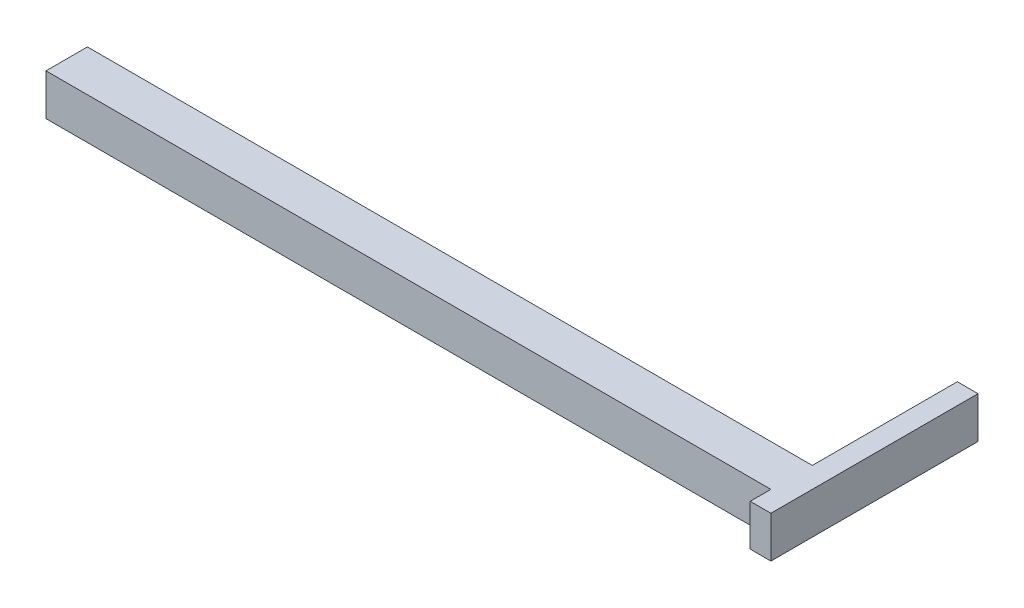
ISO-10303-21;
HEADER;
FILE_DESCRIPTION(('STEP AP214'),'2;1');
FILE_NAME('part.step','',(''),(''),'','','');
FILE_SCHEMA(('AUTOMOTIVE_DESIGN { 1 0 10303 214 1 1 1 1 }'));
ENDSEC;
DATA;
#1=APPLICATION_CONTEXT('core data for automotive mechanical design processes');
#2=APPLICATION_PROTOCOL_DEFINITION('international standard','automotive_design',2000,#1);
#3=PRODUCT_CONTEXT('',#1,'mechanical');
#4=PRODUCT('Part','Part','',(#3));
#5=PRODUCT_RELATED_PRODUCT_CATEGORY('part','',(#4));
#6=PRODUCT_DEFINITION_FORMATION('','',#4);
#7=PRODUCT_DEFINITION_CONTEXT('part definition',#1,'design');
#8=PRODUCT_DEFINITION('design','',#6,#7);
#9=PRODUCT_DEFINITION_SHAPE('','',#8);
#10=(LENGTH_UNIT() NAMED_UNIT(*) SI_UNIT(.MILLI.,.METRE.));
#11=(NAMED_UNIT(*) PLANE_ANGLE_UNIT() SI_UNIT($,.RADIAN.));
#12=(NAMED_UNIT(*) SI_UNIT($,.STERADIAN.) SOLID_ANGLE_UNIT());
#13=UNCERTAINTY_MEASURE_WITH_UNIT(LENGTH_MEASURE(1.E-05),#10,'distance_accuracy_value','');
#14=(GEOMETRIC_REPRESENTATION_CONTEXT(3) GLOBAL_UNCERTAINTY_ASSIGNED_CONTEXT((#13)) GLOBAL_UNIT_ASSIGNED_CONTEXT((#10,
#11,#12)) REPRESENTATION_CONTEXT('',''));
#15=CARTESIAN_POINT('',(0.,0.,0.));
#16=DIRECTION('',(0.,0.,1.));
#17=DIRECTION('',(1.,0.,0.));
#18=AXIS2_PLACEMENT_3D('',#15,#16,#17);
#19=CARTESIAN_POINT('',(-1750.,-100.,200.));
#20=DIRECTION('',(1.,0.,0.));
#21=DIRECTION('',(0.,0.,-1.));
#22=AXIS2_PLACEMENT_3D('',#19,#20,#21);
#23=PLANE('',#22);
#24=DIRECTION('',(0.,-1.,0.));
#25=VECTOR('',#24,1.);
#26=CARTESIAN_POINT('',(-1750.,-100.,0.));
#27=LINE('',#26,#25);
#28=CARTESIAN_POINT('',(-1750.,99.9999999999998,0.));
#29=VERTEX_POINT('',#28);
#30=CARTESIAN_POINT('',(-1750.,-100.,0.));
#31=VERTEX_POINT('',#30);
#32=EDGE_CURVE('E105',#29,#31,#27,.T.);
#33=ORIENTED_EDGE('',*,*,#32,.T.);
#34=DIRECTION('',(0.,0.,-1.));
#35=VECTOR('',#34,1.);
#36=CARTESIAN_POINT('',(-1750.,-100.,200.));
#37=LINE('',#36,#35);
#38=CARTESIAN_POINT('',(-1750.,-100.,200.));
#39=VERTEX_POINT('',#38);
#40=EDGE_CURVE('E11',#39,#31,#37,.T.);
#41=ORIENTED_EDGE('',*,*,#40,.F.);
#42=DIRECTION('',(0.,-1.,0.));
#43=VECTOR('',#42,1.);
#44=CARTESIAN_POINT('',(-1750.,-100.,200.));
#45=LINE('',#44,#43);
#46=CARTESIAN_POINT('',(-1750.,99.9999999999998,200.));
#47=VERTEX_POINT('',#46);
#48=EDGE_CURVE('E96',#47,#39,#45,.T.);
#49=ORIENTED_EDGE('',*,*,#48,.F.);
#50=DIRECTION('',(0.,0.,-1.));
#51=VECTOR('',#50,1.);
#52=CARTESIAN_POINT('',(-1750.,99.9999999999998,200.));
#53=LINE('',#52,#51);
#54=EDGE_CURVE('E48',#47,#29,#53,.T.);
#55=ORIENTED_EDGE('',*,*,#54,.T.);
#56=EDGE_LOOP('',(#33,#41,#49,#55));
#57=FACE_BOUND('',#56,.T.);
#58=ADVANCED_FACE('F39',(#57),#23,.F.);
#59=CARTESIAN_POINT('',(1750.,-99.9999999999998,200.));
#60=DIRECTION('',(0.,1.,0.));
#61=DIRECTION('',(-1.,0.,0.));
#62=AXIS2_PLACEMENT_3D('',#59,#60,#61);
#63=PLANE('',#62);
#64=DIRECTION('',(1.,0.,0.));
#65=VECTOR('',#64,1.);
#66=CARTESIAN_POINT('',(1750.,-99.9999999999998,0.));
#67=LINE('',#66,#65);
#68=CARTESIAN_POINT('',(1750.,-99.9999999999998,0.));
#69=VERTEX_POINT('',#68);
#70=EDGE_CURVE('E69',#31,#69,#67,.T.);
#71=ORIENTED_EDGE('',*,*,#70,.T.);
#72=DIRECTION('',(0.,0.,-1.));
#73=VECTOR('',#72,1.);
#74=CARTESIAN_POINT('',(1750.,-99.9999999999998,0.));
#75=LINE('',#74,#73);
#76=CARTESIAN_POINT('',(1750.,-99.9999999999998,-700.));
#77=VERTEX_POINT('',#76);
#78=EDGE_CURVE('E78',#69,#77,#75,.T.);
#79=ORIENTED_EDGE('',*,*,#78,.T.);
#80=DIRECTION('',(-1.,0.,0.));
#81=VECTOR('',#80,1.);
#82=CARTESIAN_POINT('',(1850.,-99.9999999999998,-700.));
#83=LINE('',#82,#81);
#84=CARTESIAN_POINT('',(1850.,-99.9999999999998,-700.));
#85=VERTEX_POINT('',#84);
#86=EDGE_CURVE('E129',#85,#77,#83,.T.);
#87=ORIENTED_EDGE('',*,*,#86,.F.);
#88=DIRECTION('',(0.,0.,-1.));
#89=VECTOR('',#88,1.);
#90=CARTESIAN_POINT('',(1850.,-99.9999999999998,0.));
#91=LINE('',#90,#89);
#92=CARTESIAN_POINT('',(1850.,-99.9999999999998,300.));
#93=VERTEX_POINT('',#92);
#94=EDGE_CURVE('E157',#93,#85,#91,.T.);
#95=ORIENTED_EDGE('',*,*,#94,.F.);
#96=DIRECTION('',(-1.,0.,0.));
#97=VECTOR('',#96,1.);
#98=CARTESIAN_POINT('',(1850.,-99.9999999999998,300.));
#99=LINE('',#98,#97);
#100=CARTESIAN_POINT('',(1750.,-99.9999999999998,300.));
#101=VERTEX_POINT('',#100);
#102=EDGE_CURVE('E115',#93,#101,#99,.T.);
#103=ORIENTED_EDGE('',*,*,#102,.T.);
#104=CARTESIAN_POINT('',(1750.,-99.9999999999998,200.));
#105=VERTEX_POINT('',#104);
#106=EDGE_CURVE('E93',#101,#105,#75,.T.);
#107=ORIENTED_EDGE('',*,*,#106,.T.);
#108=DIRECTION('',(1.,0.,0.));
#109=VECTOR('',#108,1.);
#110=CARTESIAN_POINT('',(1750.,-99.9999999999998,200.));
#111=LINE('',#110,#109);
#112=EDGE_CURVE('E87',#39,#105,#111,.T.);
#113=ORIENTED_EDGE('',*,*,#112,.F.);
#114=ORIENTED_EDGE('',*,*,#40,.T.);
#115=EDGE_LOOP('',(#71,#79,#87,#95,#103,#107,#113,#114));
#116=FACE_BOUND('',#115,.T.);
#117=ADVANCED_FACE('F88',(#116),#63,.F.);
#118=CARTESIAN_POINT('',(1750.,100.,200.));
#119=DIRECTION('',(0.,-1.,0.));
#120=DIRECTION('',(1.,0.,0.));
#121=AXIS2_PLACEMENT_3D('',#118,#119,#120);
#122=PLANE('',#121);
#123=DIRECTION('',(-1.,0.,0.));
#124=VECTOR('',#123,1.);
#125=CARTESIAN_POINT('',(1750.,100.,0.));
#126=LINE('',#125,#124);
#127=CARTESIAN_POINT('',(1750.,100.,0.));
#128=VERTEX_POINT('',#127);
#129=EDGE_CURVE('E103',#128,#29,#126,.T.);
#130=ORIENTED_EDGE('',*,*,#129,.T.);
#131=ORIENTED_EDGE('',*,*,#54,.F.);
#132=DIRECTION('',(-1.,0.,0.));
#133=VECTOR('',#132,1.);
#134=CARTESIAN_POINT('',(1750.,100.,200.));
#135=LINE('',#134,#133);
#136=CARTESIAN_POINT('',(1750.,100.,200.));
#137=VERTEX_POINT('',#136);
#138=EDGE_CURVE('E56',#137,#47,#135,.T.);
#139=ORIENTED_EDGE('',*,*,#138,.F.);
#140=DIRECTION('',(0.,0.,1.));
#141=VECTOR('',#140,1.);
#142=CARTESIAN_POINT('',(1750.,100.,0.));
#143=LINE('',#142,#141);
#144=CARTESIAN_POINT('',(1750.,100.,300.));
#145=VERTEX_POINT('',#144);
#146=EDGE_CURVE('E153',#137,#145,#143,.T.);
#147=ORIENTED_EDGE('',*,*,#146,.T.);
#148=DIRECTION('',(-1.,0.,0.));
#149=VECTOR('',#148,1.);
#150=CARTESIAN_POINT('',(1850.,100.,300.));
#151=LINE('',#150,#149);
#152=CARTESIAN_POINT('',(1850.,100.,300.));
#153=VERTEX_POINT('',#152);
#154=EDGE_CURVE('E108',#153,#145,#151,.T.);
#155=ORIENTED_EDGE('',*,*,#154,.F.);
#156=DIRECTION('',(0.,0.,1.));
#157=VECTOR('',#156,1.);
#158=CARTESIAN_POINT('',(1850.,100.,0.));
#159=LINE('',#158,#157);
#160=CARTESIAN_POINT('',(1850.,100.,-700.));
#161=VERTEX_POINT('',#160);
#162=EDGE_CURVE('E142',#161,#153,#159,.T.);
#163=ORIENTED_EDGE('',*,*,#162,.F.);
#164=DIRECTION('',(-1.,0.,0.));
#165=VECTOR('',#164,1.);
#166=CARTESIAN_POINT('',(1850.,100.,-700.));
#167=LINE('',#166,#165);
#168=CARTESIAN_POINT('',(1750.,100.,-700.));
#169=VERTEX_POINT('',#168);
#170=EDGE_CURVE('E133',#161,#169,#167,.T.);
#171=ORIENTED_EDGE('',*,*,#170,.T.);
#172=EDGE_CURVE('E149',#169,#128,#143,.T.);
#173=ORIENTED_EDGE('',*,*,#172,.T.);
#174=EDGE_LOOP('',(#130,#131,#139,#147,#155,#163,#171,#173));
#175=FACE_BOUND('',#174,.T.);
#176=ADVANCED_FACE('F182',(#175),#122,.F.);
#177=CARTESIAN_POINT('',(0.,0.,200.));
#178=DIRECTION('',(0.,0.,1.));
#179=DIRECTION('',(1.,0.,0.));
#180=AXIS2_PLACEMENT_3D('',#177,#178,#179);
#181=PLANE('',#180);
#182=ORIENTED_EDGE('',*,*,#48,.T.);
#183=ORIENTED_EDGE('',*,*,#112,.T.);
#184=DIRECTION('',(0.,1.,0.));
#185=VECTOR('',#184,1.);
#186=CARTESIAN_POINT('',(1750.,-99.9999999999998,200.));
#187=LINE('',#186,#185);
#188=EDGE_CURVE('E95',#105,#137,#187,.T.);
#189=ORIENTED_EDGE('',*,*,#188,.T.);
#190=ORIENTED_EDGE('',*,*,#138,.T.);
#191=EDGE_LOOP('',(#182,#183,#189,#190));
#192=FACE_BOUND('',#191,.T.);
#193=ADVANCED_FACE('F99',(#192),#181,.T.);
#194=CARTESIAN_POINT('',(0.,0.,0.));
#195=DIRECTION('',(0.,0.,1.));
#196=DIRECTION('',(1.,0.,0.));
#197=AXIS2_PLACEMENT_3D('',#194,#195,#196);
#198=PLANE('',#197);
#199=ORIENTED_EDGE('',*,*,#32,.F.);
#200=ORIENTED_EDGE('',*,*,#129,.F.);
#201=DIRECTION('',(0.,1.,0.));
#202=VECTOR('',#201,1.);
#203=CARTESIAN_POINT('',(1750.,-99.9999999999998,0.));
#204=LINE('',#203,#202);
#205=EDGE_CURVE('E112',#69,#128,#204,.T.);
#206=ORIENTED_EDGE('',*,*,#205,.F.);
#207=ORIENTED_EDGE('',*,*,#70,.F.);
#208=EDGE_LOOP('',(#199,#200,#206,#207));
#209=FACE_BOUND('',#208,.T.);
#210=ADVANCED_FACE('F201',(#209),#198,.F.);
#211=CARTESIAN_POINT('',(1750.,0.,0.));
#212=DIRECTION('',(1.,0.,0.));
#213=DIRECTION('',(0.,0.,-1.));
#214=AXIS2_PLACEMENT_3D('',#211,#212,#213);
#215=PLANE('',#214);
#216=ORIENTED_EDGE('',*,*,#78,.F.);
#217=ORIENTED_EDGE('',*,*,#205,.T.);
#218=ORIENTED_EDGE('',*,*,#172,.F.);
#219=DIRECTION('',(0.,1.,0.));
#220=VECTOR('',#219,1.);
#221=CARTESIAN_POINT('',(1750.,-99.9999999999998,-700.));
#222=LINE('',#221,#220);
#223=EDGE_CURVE('E138',#77,#169,#222,.T.);
#224=ORIENTED_EDGE('',*,*,#223,.F.);
#225=EDGE_LOOP('',(#216,#217,#218,#224));
#226=FACE_BOUND('',#225,.T.);
#227=ADVANCED_FACE('F200',(#226),#215,.F.);
#228=CARTESIAN_POINT('',(1850.,100.,300.));
#229=DIRECTION('',(0.,0.,-1.));
#230=DIRECTION('',(-1.,0.,0.));
#231=AXIS2_PLACEMENT_3D('',#228,#229,#230);
#232=PLANE('',#231);
#233=DIRECTION('',(0.,-1.,0.));
#234=VECTOR('',#233,1.);
#235=CARTESIAN_POINT('',(1750.,100.,300.));
#236=LINE('',#235,#234);
#237=EDGE_CURVE('E145',#145,#101,#236,.T.);
#238=ORIENTED_EDGE('',*,*,#237,.T.);
#239=ORIENTED_EDGE('',*,*,#102,.F.);
#240=DIRECTION('',(0.,-1.,0.));
#241=VECTOR('',#240,1.);
#242=CARTESIAN_POINT('',(1850.,100.,300.));
#243=LINE('',#242,#241);
#244=EDGE_CURVE('E161',#153,#93,#243,.T.);
#245=ORIENTED_EDGE('',*,*,#244,.F.);
#246=ORIENTED_EDGE('',*,*,#154,.T.);
#247=EDGE_LOOP('',(#238,#239,#245,#246));
#248=FACE_BOUND('',#247,.T.);
#249=ADVANCED_FACE('F186',(#248),#232,.F.);
#250=CARTESIAN_POINT('',(1850.,-99.9999999999998,-700.));
#251=DIRECTION('',(0.,0.,1.));
#252=DIRECTION('',(1.,0.,0.));
#253=AXIS2_PLACEMENT_3D('',#250,#251,#252);
#254=PLANE('',#253);
#255=ORIENTED_EDGE('',*,*,#223,.T.);
#256=ORIENTED_EDGE('',*,*,#170,.F.);
#257=DIRECTION('',(0.,1.,0.));
#258=VECTOR('',#257,1.);
#259=CARTESIAN_POINT('',(1850.,-99.9999999999998,-700.));
#260=LINE('',#259,#258);
#261=EDGE_CURVE('E137',#85,#161,#260,.T.);
#262=ORIENTED_EDGE('',*,*,#261,.F.);
#263=ORIENTED_EDGE('',*,*,#86,.T.);
#264=EDGE_LOOP('',(#255,#256,#262,#263));
#265=FACE_BOUND('',#264,.T.);
#266=ADVANCED_FACE('F232',(#265),#254,.F.);
#267=CARTESIAN_POINT('',(1850.,0.,0.));
#268=DIRECTION('',(1.,0.,0.));
#269=DIRECTION('',(0.,0.,-1.));
#270=AXIS2_PLACEMENT_3D('',#267,#268,#269);
#271=PLANE('',#270);
#272=ORIENTED_EDGE('',*,*,#162,.T.);
#273=ORIENTED_EDGE('',*,*,#244,.T.);
#274=ORIENTED_EDGE('',*,*,#94,.T.);
#275=ORIENTED_EDGE('',*,*,#261,.T.);
#276=EDGE_LOOP('',(#272,#273,#274,#275));
#277=FACE_BOUND('',#276,.T.);
#278=ADVANCED_FACE('F171',(#277),#271,.T.);
#279=ORIENTED_EDGE('',*,*,#188,.F.);
#280=ORIENTED_EDGE('',*,*,#106,.F.);
#281=ORIENTED_EDGE('',*,*,#237,.F.);
#282=ORIENTED_EDGE('',*,*,#146,.F.);
#283=EDGE_LOOP('',(#279,#280,#281,#282));
#284=FACE_BOUND('',#283,.T.);
#285=ADVANCED_FACE('F210',(#284),#215,.F.);
#286=CLOSED_SHELL('',(#58,#117,#176,#193,#210,#227,#249,#266,#278,#285));
#287=MANIFOLD_SOLID_BREP('B2',#286);
#288=ADVANCED_BREP_SHAPE_REPRESENTATION('',(#18,#287),#14);
#289=SHAPE_DEFINITION_REPRESENTATION(#9,#288);
ENDSEC;
END-ISO-10303-21;
